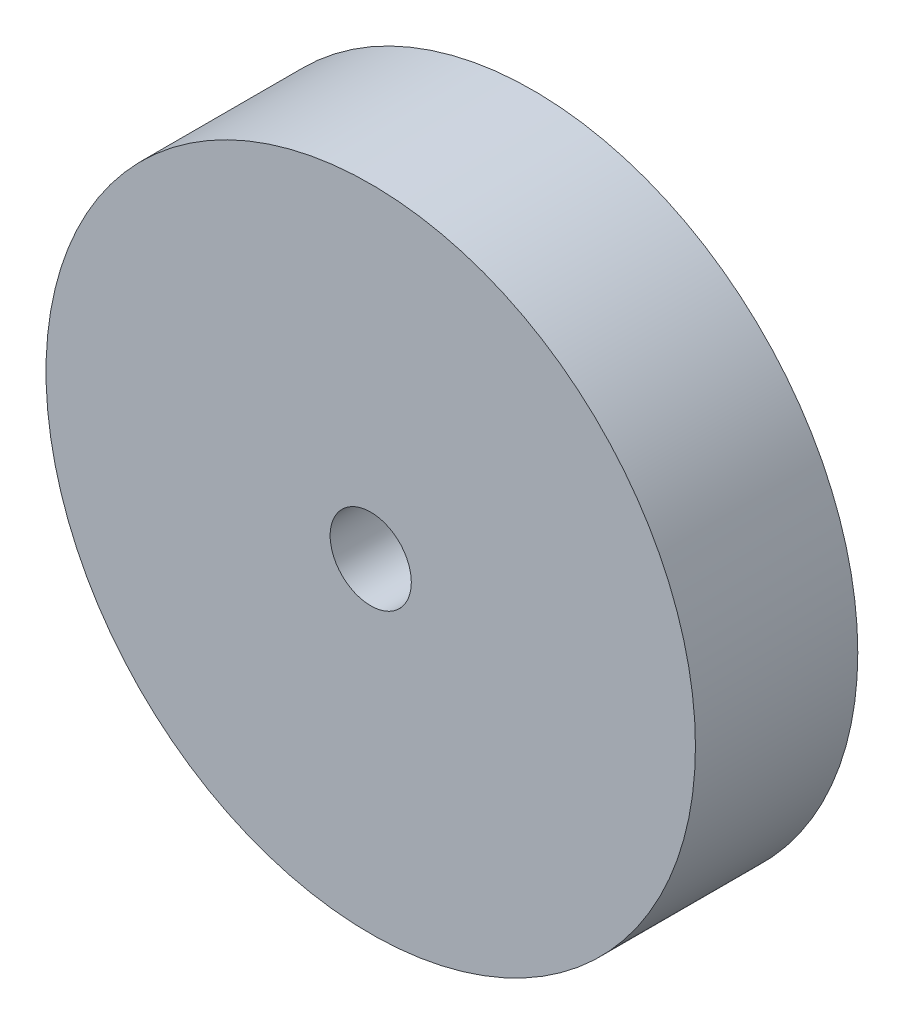
ISO-10303-21;
HEADER;
FILE_DESCRIPTION(('STEP AP214'),'2;1');
FILE_NAME('part.step','',(''),(''),'','','');
FILE_SCHEMA(('AUTOMOTIVE_DESIGN { 1 0 10303 214 1 1 1 1 }'));
ENDSEC;
DATA;
#1=APPLICATION_CONTEXT('core data for automotive mechanical design processes');
#2=APPLICATION_PROTOCOL_DEFINITION('international standard','automotive_design',2000,#1);
#3=PRODUCT_CONTEXT('',#1,'mechanical');
#4=PRODUCT('Part','Part','',(#3));
#5=PRODUCT_RELATED_PRODUCT_CATEGORY('part','',(#4));
#6=PRODUCT_DEFINITION_FORMATION('','',#4);
#7=PRODUCT_DEFINITION_CONTEXT('part definition',#1,'design');
#8=PRODUCT_DEFINITION('design','',#6,#7);
#9=PRODUCT_DEFINITION_SHAPE('','',#8);
#10=(LENGTH_UNIT() NAMED_UNIT(*) SI_UNIT(.MILLI.,.METRE.));
#11=(NAMED_UNIT(*) PLANE_ANGLE_UNIT() SI_UNIT($,.RADIAN.));
#12=(NAMED_UNIT(*) SI_UNIT($,.STERADIAN.) SOLID_ANGLE_UNIT());
#13=UNCERTAINTY_MEASURE_WITH_UNIT(LENGTH_MEASURE(1.E-05),#10,'distance_accuracy_value','');
#14=(GEOMETRIC_REPRESENTATION_CONTEXT(3) GLOBAL_UNCERTAINTY_ASSIGNED_CONTEXT((#13)) GLOBAL_UNIT_ASSIGNED_CONTEXT((#10,
#11,#12)) REPRESENTATION_CONTEXT('',''));
#15=CARTESIAN_POINT('',(0.,0.,0.));
#16=DIRECTION('',(0.,0.,1.));
#17=DIRECTION('',(1.,0.,0.));
#18=AXIS2_PLACEMENT_3D('',#15,#16,#17);
#19=CARTESIAN_POINT('',(0.,0.,12.7));
#20=DIRECTION('',(0.,0.,-1.));
#21=DIRECTION('',(-1.,0.,0.));
#22=AXIS2_PLACEMENT_3D('',#19,#20,#21);
#23=CYLINDRICAL_SURFACE('',#22,25.4);
#24=CARTESIAN_POINT('',(0.,0.,12.7));
#25=DIRECTION('',(0.,0.,1.));
#26=DIRECTION('',(1.,0.,0.));
#27=AXIS2_PLACEMENT_3D('',#24,#25,#26);
#28=CIRCLE('',#27,25.4);
#29=CARTESIAN_POINT('',(25.4,0.,12.7));
#30=VERTEX_POINT('',#29);
#31=EDGE_CURVE('E10',#30,#30,#28,.T.);
#32=ORIENTED_EDGE('',*,*,#31,.F.);
#33=EDGE_LOOP('',(#32));
#34=FACE_BOUND('',#33,.T.);
#35=CARTESIAN_POINT('',(0.,0.,0.));
#36=DIRECTION('',(0.,0.,1.));
#37=DIRECTION('',(1.,0.,0.));
#38=AXIS2_PLACEMENT_3D('',#35,#36,#37);
#39=CIRCLE('',#38,25.4);
#40=CARTESIAN_POINT('',(25.4,0.,0.));
#41=VERTEX_POINT('',#40);
#42=EDGE_CURVE('E35',#41,#41,#39,.T.);
#43=ORIENTED_EDGE('',*,*,#42,.T.);
#44=EDGE_LOOP('',(#43));
#45=FACE_BOUND('',#44,.T.);
#46=ADVANCED_FACE('F32',(#34,#45),#23,.T.);
#47=CARTESIAN_POINT('',(0.,0.,12.7));
#48=DIRECTION('',(0.,0.,1.));
#49=DIRECTION('',(1.,0.,0.));
#50=AXIS2_PLACEMENT_3D('',#47,#48,#49);
#51=PLANE('',#50);
#52=CARTESIAN_POINT('',(0.,0.,12.7));
#53=DIRECTION('',(0.,0.,1.));
#54=DIRECTION('',(1.,0.,0.));
#55=AXIS2_PLACEMENT_3D('',#52,#53,#54);
#56=CIRCLE('',#55,3.175);
#57=CARTESIAN_POINT('',(3.175,0.,12.7));
#58=VERTEX_POINT('',#57);
#59=EDGE_CURVE('E44',#58,#58,#56,.T.);
#60=ORIENTED_EDGE('',*,*,#59,.F.);
#61=EDGE_LOOP('',(#60));
#62=FACE_BOUND('',#61,.T.);
#63=ORIENTED_EDGE('',*,*,#31,.T.);
#64=EDGE_LOOP('',(#63));
#65=FACE_BOUND('',#64,.T.);
#66=ADVANCED_FACE('F59',(#62,#65),#51,.T.);
#67=CARTESIAN_POINT('',(0.,0.,0.));
#68=DIRECTION('',(0.,0.,1.));
#69=DIRECTION('',(1.,0.,0.));
#70=AXIS2_PLACEMENT_3D('',#67,#68,#69);
#71=PLANE('',#70);
#72=ORIENTED_EDGE('',*,*,#42,.F.);
#73=EDGE_LOOP('',(#72));
#74=FACE_BOUND('',#73,.T.);
#75=ADVANCED_FACE('F55',(#74),#71,.F.);
#76=CARTESIAN_POINT('',(0.,0.,6.35));
#77=DIRECTION('',(0.,0.,1.));
#78=DIRECTION('',(1.,0.,0.));
#79=AXIS2_PLACEMENT_3D('',#76,#77,#78);
#80=CYLINDRICAL_SURFACE('',#79,3.175);
#81=CARTESIAN_POINT('',(0.,0.,6.35));
#82=DIRECTION('',(0.,0.,1.));
#83=DIRECTION('',(1.,0.,0.));
#84=AXIS2_PLACEMENT_3D('',#81,#82,#83);
#85=CIRCLE('',#84,3.175);
#86=CARTESIAN_POINT('',(3.175,0.,6.35));
#87=VERTEX_POINT('',#86);
#88=EDGE_CURVE('E42',#87,#87,#85,.T.);
#89=ORIENTED_EDGE('',*,*,#88,.F.);
#90=EDGE_LOOP('',(#89));
#91=FACE_BOUND('',#90,.T.);
#92=ORIENTED_EDGE('',*,*,#59,.T.);
#93=EDGE_LOOP('',(#92));
#94=FACE_BOUND('',#93,.T.);
#95=ADVANCED_FACE('F52',(#91,#94),#80,.F.);
#96=CARTESIAN_POINT('',(0.,0.,6.35));
#97=DIRECTION('',(0.,0.,1.));
#98=DIRECTION('',(1.,0.,0.));
#99=AXIS2_PLACEMENT_3D('',#96,#97,#98);
#100=PLANE('',#99);
#101=ORIENTED_EDGE('',*,*,#88,.T.);
#102=EDGE_LOOP('',(#101));
#103=FACE_BOUND('',#102,.T.);
#104=ADVANCED_FACE('F50',(#103),#100,.T.);
#105=CLOSED_SHELL('',(#46,#66,#75,#95,#104));
#106=MANIFOLD_SOLID_BREP('B2',#105);
#107=ADVANCED_BREP_SHAPE_REPRESENTATION('',(#18,#106),#14);
#108=SHAPE_DEFINITION_REPRESENTATION(#9,#107);
ENDSEC;
END-ISO-10303-21;
